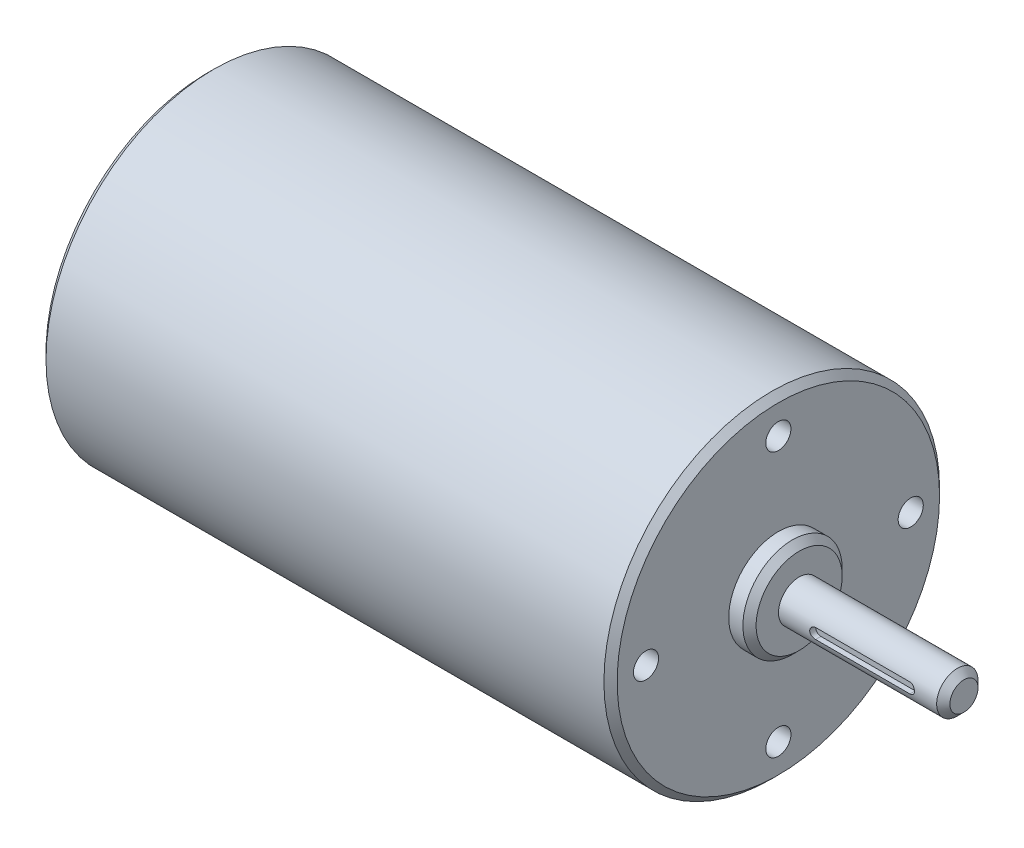
ISO-10303-21;
HEADER;
FILE_DESCRIPTION(('STEP AP214'),'2;1');
FILE_NAME('part.step','',(''),(''),'','','');
FILE_SCHEMA(('AUTOMOTIVE_DESIGN { 1 0 10303 214 1 1 1 1 }'));
ENDSEC;
DATA;
#1=APPLICATION_CONTEXT('core data for automotive mechanical design processes');
#2=APPLICATION_PROTOCOL_DEFINITION('international standard','automotive_design',2000,#1);
#3=PRODUCT_CONTEXT('',#1,'mechanical');
#4=PRODUCT('Part','Part','',(#3));
#5=PRODUCT_RELATED_PRODUCT_CATEGORY('part','',(#4));
#6=PRODUCT_DEFINITION_FORMATION('','',#4);
#7=PRODUCT_DEFINITION_CONTEXT('part definition',#1,'design');
#8=PRODUCT_DEFINITION('design','',#6,#7);
#9=PRODUCT_DEFINITION_SHAPE('','',#8);
#10=(LENGTH_UNIT() NAMED_UNIT(*) SI_UNIT(.MILLI.,.METRE.));
#11=(NAMED_UNIT(*) PLANE_ANGLE_UNIT() SI_UNIT($,.RADIAN.));
#12=(NAMED_UNIT(*) SI_UNIT($,.STERADIAN.) SOLID_ANGLE_UNIT());
#13=UNCERTAINTY_MEASURE_WITH_UNIT(LENGTH_MEASURE(1.E-05),#10,'distance_accuracy_value','');
#14=(GEOMETRIC_REPRESENTATION_CONTEXT(3) GLOBAL_UNCERTAINTY_ASSIGNED_CONTEXT((#13)) GLOBAL_UNIT_ASSIGNED_CONTEXT((#10,
#11,#12)) REPRESENTATION_CONTEXT('',''));
#15=CARTESIAN_POINT('',(0.,0.,0.));
#16=DIRECTION('',(0.,0.,1.));
#17=DIRECTION('',(1.,0.,0.));
#18=AXIS2_PLACEMENT_3D('',#15,#16,#17);
#19=CARTESIAN_POINT('',(0.,0.,0.));
#20=DIRECTION('',(1.,0.,0.));
#21=DIRECTION('',(0.,0.,-1.));
#22=AXIS2_PLACEMENT_3D('',#19,#20,#21);
#23=PLANE('',#22);
#24=CARTESIAN_POINT('',(0.,0.,0.));
#25=DIRECTION('',(1.,0.,0.));
#26=DIRECTION('',(0.,0.,-1.));
#27=AXIS2_PLACEMENT_3D('',#24,#25,#26);
#28=CIRCLE('',#27,30.9372);
#29=CARTESIAN_POINT('',(0.,0.,-30.9372));
#30=VERTEX_POINT('',#29);
#31=EDGE_CURVE('E117',#30,#30,#28,.F.);
#32=ORIENTED_EDGE('',*,*,#31,.T.);
#33=EDGE_LOOP('',(#32));
#34=FACE_BOUND('',#33,.T.);
#35=CARTESIAN_POINT('',(0.,0.,0.));
#36=DIRECTION('',(1.,0.,0.));
#37=DIRECTION('',(0.,0.,-1.));
#38=AXIS2_PLACEMENT_3D('',#35,#36,#37);
#39=CIRCLE('',#38,15.24);
#40=CARTESIAN_POINT('',(0.,0.,-15.24));
#41=VERTEX_POINT('',#40);
#42=EDGE_CURVE('E138',#41,#41,#39,.F.);
#43=ORIENTED_EDGE('',*,*,#42,.F.);
#44=EDGE_LOOP('',(#43));
#45=FACE_BOUND('',#44,.T.);
#46=ADVANCED_FACE('F34',(#34,#45),#23,.F.);
#47=CARTESIAN_POINT('',(113.5888,0.,0.));
#48=DIRECTION('',(1.,0.,0.));
#49=DIRECTION('',(0.,0.,-1.));
#50=AXIS2_PLACEMENT_3D('',#47,#48,#49);
#51=PLANE('',#50);
#52=CARTESIAN_POINT('',(113.5888,0.,0.));
#53=DIRECTION('',(1.,0.,0.));
#54=DIRECTION('',(0.,0.,-1.));
#55=AXIS2_PLACEMENT_3D('',#52,#53,#54);
#56=CIRCLE('',#55,8.25499999999998);
#57=CARTESIAN_POINT('',(113.5888,0.,-8.25499999999998));
#58=VERTEX_POINT('',#57);
#59=EDGE_CURVE('E126',#58,#58,#56,.T.);
#60=ORIENTED_EDGE('',*,*,#59,.T.);
#61=EDGE_LOOP('',(#60));
#62=FACE_BOUND('',#61,.T.);
#63=CARTESIAN_POINT('',(113.5888,0.,0.));
#64=DIRECTION('',(1.,0.,0.));
#65=DIRECTION('',(0.,0.,-1.));
#66=AXIS2_PLACEMENT_3D('',#63,#64,#65);
#67=CIRCLE('',#66,3.96875);
#68=CARTESIAN_POINT('',(113.5888,0.,-3.96875));
#69=VERTEX_POINT('',#68);
#70=EDGE_CURVE('E105',#69,#69,#67,.T.);
#71=ORIENTED_EDGE('',*,*,#70,.F.);
#72=EDGE_LOOP('',(#71));
#73=FACE_BOUND('',#72,.T.);
#74=ADVANCED_FACE('F196',(#62,#73),#51,.T.);
#75=CARTESIAN_POINT('',(109.601,0.,0.));
#76=DIRECTION('',(1.,0.,0.));
#77=DIRECTION('',(0.,0.,-1.));
#78=AXIS2_PLACEMENT_3D('',#75,#76,#77);
#79=PLANE('',#78);
#80=CARTESIAN_POINT('',(109.601,-3.54734504026462E-13,25.3999999999996));
#81=DIRECTION('',(1.,0.,0.));
#82=DIRECTION('',(0.,0.,-1.));
#83=AXIS2_PLACEMENT_3D('',#80,#81,#82);
#84=CIRCLE('',#83,2.4130000000007);
#85=CARTESIAN_POINT('',(109.601,-3.54734504026462E-13,22.9869999999989));
#86=VERTEX_POINT('',#85);
#87=EDGE_CURVE('E442',#86,#86,#84,.T.);
#88=ORIENTED_EDGE('',*,*,#87,.F.);
#89=EDGE_LOOP('',(#88));
#90=FACE_BOUND('',#89,.T.);
#91=CARTESIAN_POINT('',(109.601,-25.4,-7.15690213792593E-13));
#92=DIRECTION('',(1.,0.,0.));
#93=DIRECTION('',(0.,0.,-1.));
#94=AXIS2_PLACEMENT_3D('',#91,#92,#93);
#95=CIRCLE('',#94,2.41300000000085);
#96=CARTESIAN_POINT('',(109.601,-25.4,-2.41300000000157));
#97=VERTEX_POINT('',#96);
#98=EDGE_CURVE('E446',#97,#97,#95,.T.);
#99=ORIENTED_EDGE('',*,*,#98,.F.);
#100=EDGE_LOOP('',(#99));
#101=FACE_BOUND('',#100,.T.);
#102=CARTESIAN_POINT('',(109.601,0.,-25.4));
#103=DIRECTION('',(1.,0.,0.));
#104=DIRECTION('',(0.,0.,-1.));
#105=AXIS2_PLACEMENT_3D('',#102,#103,#104);
#106=CIRCLE('',#105,2.413);
#107=CARTESIAN_POINT('',(109.601,0.,-27.813));
#108=VERTEX_POINT('',#107);
#109=EDGE_CURVE('E450',#108,#108,#106,.T.);
#110=ORIENTED_EDGE('',*,*,#109,.F.);
#111=EDGE_LOOP('',(#110));
#112=FACE_BOUND('',#111,.T.);
#113=CARTESIAN_POINT('',(109.601,25.4,0.));
#114=DIRECTION('',(1.,0.,0.));
#115=DIRECTION('',(0.,0.,-1.));
#116=AXIS2_PLACEMENT_3D('',#113,#114,#115);
#117=CIRCLE('',#116,2.413);
#118=CARTESIAN_POINT('',(109.601,25.4,-2.413));
#119=VERTEX_POINT('',#118);
#120=EDGE_CURVE('E97',#119,#119,#117,.T.);
#121=ORIENTED_EDGE('',*,*,#120,.F.);
#122=EDGE_LOOP('',(#121));
#123=FACE_BOUND('',#122,.T.);
#124=CARTESIAN_POINT('',(109.601,0.,0.));
#125=DIRECTION('',(1.,0.,0.));
#126=DIRECTION('',(0.,0.,-1.));
#127=AXIS2_PLACEMENT_3D('',#124,#125,#126);
#128=CIRCLE('',#127,30.9372);
#129=CARTESIAN_POINT('',(109.601,0.,-30.9372));
#130=VERTEX_POINT('',#129);
#131=EDGE_CURVE('E120',#130,#130,#128,.T.);
#132=ORIENTED_EDGE('',*,*,#131,.T.);
#133=EDGE_LOOP('',(#132));
#134=FACE_BOUND('',#133,.T.);
#135=CARTESIAN_POINT('',(109.601,0.,0.));
#136=DIRECTION('',(1.,0.,0.));
#137=DIRECTION('',(0.,0.,-1.));
#138=AXIS2_PLACEMENT_3D('',#135,#136,#137);
#139=CIRCLE('',#138,9.525);
#140=CARTESIAN_POINT('',(109.601,0.,-9.525));
#141=VERTEX_POINT('',#140);
#142=EDGE_CURVE('E111',#141,#141,#139,.T.);
#143=ORIENTED_EDGE('',*,*,#142,.F.);
#144=EDGE_LOOP('',(#143));
#145=FACE_BOUND('',#144,.T.);
#146=ADVANCED_FACE('F202',(#90,#101,#112,#123,#134,#145),#79,.T.);
#147=CARTESIAN_POINT('',(109.601,0.,0.));
#148=DIRECTION('',(-1.,0.,0.));
#149=DIRECTION('',(0.,0.,1.));
#150=AXIS2_PLACEMENT_3D('',#147,#148,#149);
#151=CYLINDRICAL_SURFACE('',#150,32.2072);
#152=CARTESIAN_POINT('',(108.331,0.,0.));
#153=DIRECTION('',(1.,0.,0.));
#154=DIRECTION('',(0.,0.,-1.));
#155=AXIS2_PLACEMENT_3D('',#152,#153,#154);
#156=CIRCLE('',#155,32.2072);
#157=CARTESIAN_POINT('',(108.331,0.,-32.2072));
#158=VERTEX_POINT('',#157);
#159=EDGE_CURVE('E123',#158,#158,#156,.F.);
#160=ORIENTED_EDGE('',*,*,#159,.T.);
#161=EDGE_LOOP('',(#160));
#162=FACE_BOUND('',#161,.T.);
#163=CARTESIAN_POINT('',(1.26999999999999,0.,0.));
#164=DIRECTION('',(1.,0.,0.));
#165=DIRECTION('',(0.,0.,-1.));
#166=AXIS2_PLACEMENT_3D('',#163,#164,#165);
#167=CIRCLE('',#166,32.2072);
#168=CARTESIAN_POINT('',(1.26999999999999,0.,-32.2072));
#169=VERTEX_POINT('',#168);
#170=EDGE_CURVE('E114',#169,#169,#167,.T.);
#171=ORIENTED_EDGE('',*,*,#170,.T.);
#172=EDGE_LOOP('',(#171));
#173=FACE_BOUND('',#172,.T.);
#174=ADVANCED_FACE('F208',(#162,#173),#151,.T.);
#175=CARTESIAN_POINT('',(1.26999999999999,0.,0.));
#176=DIRECTION('',(1.,0.,0.));
#177=DIRECTION('',(0.,0.,-1.));
#178=AXIS2_PLACEMENT_3D('',#175,#176,#177);
#179=CONICAL_SURFACE('',#178,32.2072,0.785398163397456);
#180=ORIENTED_EDGE('',*,*,#31,.F.);
#181=EDGE_LOOP('',(#180));
#182=FACE_BOUND('',#181,.T.);
#183=ORIENTED_EDGE('',*,*,#170,.F.);
#184=EDGE_LOOP('',(#183));
#185=FACE_BOUND('',#184,.T.);
#186=ADVANCED_FACE('F211',(#182,#185),#179,.T.);
#187=CARTESIAN_POINT('',(109.601,0.,0.));
#188=DIRECTION('',(-1.,0.,0.));
#189=DIRECTION('',(0.,0.,1.));
#190=AXIS2_PLACEMENT_3D('',#187,#188,#189);
#191=CONICAL_SURFACE('',#190,30.9372,0.78539816339744);
#192=ORIENTED_EDGE('',*,*,#159,.F.);
#193=EDGE_LOOP('',(#192));
#194=FACE_BOUND('',#193,.T.);
#195=ORIENTED_EDGE('',*,*,#131,.F.);
#196=EDGE_LOOP('',(#195));
#197=FACE_BOUND('',#196,.T.);
#198=ADVANCED_FACE('F215',(#194,#197),#191,.T.);
#199=CARTESIAN_POINT('',(113.5888,0.,0.));
#200=DIRECTION('',(-1.,0.,0.));
#201=DIRECTION('',(0.,0.,1.));
#202=AXIS2_PLACEMENT_3D('',#199,#200,#201);
#203=CYLINDRICAL_SURFACE('',#202,9.525);
#204=CARTESIAN_POINT('',(112.3188,0.,0.));
#205=DIRECTION('',(1.,0.,0.));
#206=DIRECTION('',(0.,0.,-1.));
#207=AXIS2_PLACEMENT_3D('',#204,#205,#206);
#208=CIRCLE('',#207,9.525);
#209=CARTESIAN_POINT('',(112.3188,0.,-9.525));
#210=VERTEX_POINT('',#209);
#211=EDGE_CURVE('E129',#210,#210,#208,.F.);
#212=ORIENTED_EDGE('',*,*,#211,.T.);
#213=EDGE_LOOP('',(#212));
#214=FACE_BOUND('',#213,.T.);
#215=ORIENTED_EDGE('',*,*,#142,.T.);
#216=EDGE_LOOP('',(#215));
#217=FACE_BOUND('',#216,.T.);
#218=ADVANCED_FACE('F193',(#214,#217),#203,.T.);
#219=CARTESIAN_POINT('',(145.2118,0.,0.));
#220=DIRECTION('',(-1.,0.,0.));
#221=DIRECTION('',(0.,0.,1.));
#222=AXIS2_PLACEMENT_3D('',#219,#220,#221);
#223=CYLINDRICAL_SURFACE('',#222,3.96875);
#224=DIRECTION('',(-1.,0.,0.));
#225=VECTOR('',#224,1.);
#226=CARTESIAN_POINT('',(145.2118,0.99949,3.84083276157658));
#227=LINE('',#226,#225);
#228=CARTESIAN_POINT('',(120.58269,0.99949,3.84083276157658));
#229=VERTEX_POINT('',#228);
#230=CARTESIAN_POINT('',(138.68273,0.99949,3.84083276157658));
#231=VERTEX_POINT('',#230);
#232=EDGE_CURVE('E11',#229,#231,#227,.F.);
#233=ORIENTED_EDGE('',*,*,#232,.T.);
#234=CARTESIAN_POINT('',(138.68273,0.99949,3.84083276157658));
#235=CARTESIAN_POINT('',(138.710371855366,0.99949034508258,3.84083088535486));
#236=CARTESIAN_POINT('',(138.738000006681,0.998342576022411,3.84113154192625));
#237=CARTESIAN_POINT('',(138.793049543949,0.993767145090672,3.84231853671911));
#238=CARTESIAN_POINT('',(138.820470964276,0.990339871100076,3.84320477529766));
#239=CARTESIAN_POINT('',(138.902013552574,0.976688942242754,3.84670622445485));
#240=CARTESIAN_POINT('',(138.95557415162,0.96309595921762,3.8501643895329));
#241=CARTESIAN_POINT('',(139.059558693131,0.927365951048453,3.8589250519512));
#242=CARTESIAN_POINT('',(139.109982956344,0.905229801274279,3.86422736032704));
#243=CARTESIAN_POINT('',(139.206427816238,0.853068713817862,3.87607577201493));
#244=CARTESIAN_POINT('',(139.252447197867,0.823041607982738,3.88262221703424));
#245=CARTESIAN_POINT('',(139.339772900892,0.755242877856895,3.89638316090741));
#246=CARTESIAN_POINT('',(139.380966638586,0.717328459170463,3.9036083969745));
#247=CARTESIAN_POINT('',(139.456486118574,0.635135353050957,3.91782036547613));
#248=CARTESIAN_POINT('',(139.490810761316,0.590855648657175,3.92480705957846));
#249=CARTESIAN_POINT('',(139.552077986148,0.49641361018235,3.93787391802068));
#250=CARTESIAN_POINT('',(139.57890911343,0.446176832822011,3.94393983940319));
#251=CARTESIAN_POINT('',(139.623701811812,0.341730216786056,3.95435799835552));
#252=CARTESIAN_POINT('',(139.641665146491,0.287521170558453,3.95871057663079));
#253=CARTESIAN_POINT('',(139.66785096089,0.177847779961227,3.96513566928748));
#254=CARTESIAN_POINT('',(139.676265855839,0.122432057522644,3.96725316041096));
#255=CARTESIAN_POINT('',(139.683720120741,0.0109364897009776,3.96912630891355));
#256=CARTESIAN_POINT('',(139.682760689181,-0.045143269870698,3.96888226820973));
#257=CARTESIAN_POINT('',(139.671631248994,-0.155037457909628,3.96609318102902));
#258=CARTESIAN_POINT('',(139.661669160231,-0.208874460448489,3.96360007973907));
#259=CARTESIAN_POINT('',(139.633151687584,-0.314086111079225,3.95665360881696));
#260=CARTESIAN_POINT('',(139.614595920318,-0.36546064920236,3.95220015172949));
#261=CARTESIAN_POINT('',(139.569250319442,-0.464836153211505,3.94175409964869));
#262=CARTESIAN_POINT('',(139.542386681345,-0.512801940790663,3.93574779138535));
#263=CARTESIAN_POINT('',(139.481244450101,-0.603616233347936,3.9228472937741));
#264=CARTESIAN_POINT('',(139.446964720246,-0.646463952283368,3.9159529683799));
#265=CARTESIAN_POINT('',(139.37085470223,-0.727062667015122,3.90180452536138));
#266=CARTESIAN_POINT('',(139.328843536622,-0.764642201053514,3.89454572456579));
#267=CARTESIAN_POINT('',(139.239027431868,-0.832270101802583,3.8806569962431));
#268=CARTESIAN_POINT('',(139.19122091086,-0.862316405394657,3.8740272413005));
#269=CARTESIAN_POINT('',(139.090823163687,-0.914139275858822,3.86212887883412));
#270=CARTESIAN_POINT('',(139.038207004781,-0.935869323009422,3.85686797939342));
#271=CARTESIAN_POINT('',(138.929934724949,-0.970093898104302,3.84840362082549));
#272=CARTESIAN_POINT('',(138.874283285139,-0.982602238420151,3.84519708559696));
#273=CARTESIAN_POINT('',(138.795578801122,-0.993358173202812,3.84242408867529));
#274=CARTESIAN_POINT('',(138.773055913649,-0.995657985499729,3.84182827516651));
#275=CARTESIAN_POINT('',(138.727935595249,-0.998722182802392,3.84103278115428));
#276=CARTESIAN_POINT('',(138.705338343949,-0.999489046647041,3.84083246112855));
#277=CARTESIAN_POINT('',(138.68273,-0.99949,3.84083276157658));
#278=B_SPLINE_CURVE_WITH_KNOTS('',3,(#234,#235,#236,#237,#238,#239,#240,#241,#242,#243,#244,
#245,#246,#247,#248,#249,#250,#251,#252,#253,#254,#255,#256,#257,#258,#259,#260,#261,#262,#263,
#264,#265,#266,#267,#268,#269,#270,#271,#272,#273,#274,#275,#276,#277),.UNSPECIFIED.,.F.,.F.,(4,
2,2,2,2,2,2,2,2,2,2,2,2,2,2,2,2,2,2,2,2,4),(0.,0.0828731579444143,0.165732217783698,
0.330973339294841,0.496197533978411,0.66146717392123,0.830040056608364,0.998639901623819,
1.1696279790933,1.34058203766956,1.5080262825965,1.67544912039758,1.83910139518618,
2.00276097156208,2.16791837132419,2.33310110374766,2.50280192406036,2.67254916953174,
2.84323253669063,3.0136597301703,3.08155871780525,3.14934782095868),.UNSPECIFIED.);
#279=CARTESIAN_POINT('',(138.68273,-0.99949,3.84083276157658));
#280=VERTEX_POINT('',#279);
#281=EDGE_CURVE('E147',#231,#280,#278,.T.);
#282=ORIENTED_EDGE('',*,*,#281,.T.);
#283=DIRECTION('',(-1.,0.,0.));
#284=VECTOR('',#283,1.);
#285=CARTESIAN_POINT('',(145.2118,-0.99949,3.84083276157658));
#286=LINE('',#285,#284);
#287=CARTESIAN_POINT('',(120.58269,-0.99949,3.84083276157658));
#288=VERTEX_POINT('',#287);
#289=EDGE_CURVE('E42',#280,#288,#286,.T.);
#290=ORIENTED_EDGE('',*,*,#289,.T.);
#291=CARTESIAN_POINT('',(120.58269,-0.99949,3.84083276157658));
#292=CARTESIAN_POINT('',(120.555048144634,-0.999490345082581,3.84083088535486));
#293=CARTESIAN_POINT('',(120.527419993319,-0.998342576022412,3.84113154192625));
#294=CARTESIAN_POINT('',(120.472370456051,-0.993767145090673,3.84231853671911));
#295=CARTESIAN_POINT('',(120.444949035724,-0.990339871100075,3.84320477529766));
#296=CARTESIAN_POINT('',(120.363406447426,-0.976688942242751,3.84670622445485));
#297=CARTESIAN_POINT('',(120.30984584838,-0.963095959217618,3.8501643895329));
#298=CARTESIAN_POINT('',(120.205861306869,-0.927365951048453,3.8589250519512));
#299=CARTESIAN_POINT('',(120.155437043656,-0.905229801274277,3.86422736032704));
#300=CARTESIAN_POINT('',(120.058992183762,-0.853068713817854,3.87607577201493));
#301=CARTESIAN_POINT('',(120.012972802133,-0.823041607982726,3.88262221703424));
#302=CARTESIAN_POINT('',(119.925647099108,-0.755242877856881,3.89638316090742));
#303=CARTESIAN_POINT('',(119.884453361414,-0.717328459170449,3.9036083969745));
#304=CARTESIAN_POINT('',(119.808933881426,-0.63513535305094,3.91782036547613));
#305=CARTESIAN_POINT('',(119.774609238684,-0.590855648657156,3.92480705957846));
#306=CARTESIAN_POINT('',(119.713342013852,-0.496413610182332,3.93787391802068));
#307=CARTESIAN_POINT('',(119.68651088657,-0.446176832821996,3.94393983940319));
#308=CARTESIAN_POINT('',(119.641718188188,-0.341730216786044,3.95435799835552));
#309=CARTESIAN_POINT('',(119.623754853509,-0.287521170558441,3.95871057663079));
#310=CARTESIAN_POINT('',(119.59756903911,-0.177847779961219,3.96513566928748));
#311=CARTESIAN_POINT('',(119.589154144161,-0.122432057522639,3.96725316041096));
#312=CARTESIAN_POINT('',(119.581699879259,-0.0109364897009769,3.96912630891355));
#313=CARTESIAN_POINT('',(119.582659310819,0.0451432698706966,3.96888226820973));
#314=CARTESIAN_POINT('',(119.593788751006,0.155037457909627,3.96609318102902));
#315=CARTESIAN_POINT('',(119.603750839769,0.208874460448488,3.96360007973907));
#316=CARTESIAN_POINT('',(119.632268312416,0.314086111079224,3.95665360881696));
#317=CARTESIAN_POINT('',(119.650824079682,0.365460649202358,3.95220015172949));
#318=CARTESIAN_POINT('',(119.696169680558,0.4648361532115,3.94175409964869));
#319=CARTESIAN_POINT('',(119.723033318655,0.512801940790658,3.93574779138535));
#320=CARTESIAN_POINT('',(119.784175549898,0.603616233347931,3.9228472937741));
#321=CARTESIAN_POINT('',(119.818455279754,0.646463952283364,3.9159529683799));
#322=CARTESIAN_POINT('',(119.89456529777,0.727062667015116,3.90180452536138));
#323=CARTESIAN_POINT('',(119.936576463378,0.764642201053506,3.89454572456579));
#324=CARTESIAN_POINT('',(120.026392568132,0.832270101802575,3.8806569962431));
#325=CARTESIAN_POINT('',(120.07419908914,0.862316405394651,3.8740272413005));
#326=CARTESIAN_POINT('',(120.174596836313,0.914139275858827,3.86212887883412));
#327=CARTESIAN_POINT('',(120.227212995219,0.935869323009432,3.85686797939342));
#328=CARTESIAN_POINT('',(120.335485275051,0.970093898104309,3.84840362082548));
#329=CARTESIAN_POINT('',(120.391136714861,0.982602238420156,3.84519708559696));
#330=CARTESIAN_POINT('',(120.469841198878,0.993358173202814,3.84242408867529));
#331=CARTESIAN_POINT('',(120.492364086351,0.995657985499731,3.84182827516651));
#332=CARTESIAN_POINT('',(120.537484404751,0.998722182802391,3.84103278115428));
#333=CARTESIAN_POINT('',(120.560081656051,0.99948904664704,3.84083246112855));
#334=CARTESIAN_POINT('',(120.58269,0.99949,3.84083276157658));
#335=B_SPLINE_CURVE_WITH_KNOTS('',3,(#291,#292,#293,#294,#295,#296,#297,#298,#299,#300,#301,
#302,#303,#304,#305,#306,#307,#308,#309,#310,#311,#312,#313,#314,#315,#316,#317,#318,#319,#320,
#321,#322,#323,#324,#325,#326,#327,#328,#329,#330,#331,#332,#333,#334),.UNSPECIFIED.,.F.,.F.,(4,
2,2,2,2,2,2,2,2,2,2,2,2,2,2,2,2,2,2,2,2,4),(0.,0.0828731579444004,0.165732217783698,
0.330973339294841,0.496197533978427,0.661467173921234,0.830040056608397,0.998639901623839,
1.16962797909332,1.34058203766957,1.50802628259651,1.67544912039758,1.83910139518618,
2.00276097156208,2.16791837132417,2.33310110374765,2.50280192406034,2.67254916953173,
2.84323253669067,3.01365973017031,3.08155871780528,3.14934782095868),.UNSPECIFIED.);
#336=EDGE_CURVE('E49',#288,#229,#335,.T.);
#337=ORIENTED_EDGE('',*,*,#336,.T.);
#338=EDGE_LOOP('',(#233,#282,#290,#337));
#339=FACE_BOUND('',#338,.T.);
#340=CARTESIAN_POINT('',(143.9418,0.,0.));
#341=DIRECTION('',(1.,0.,0.));
#342=DIRECTION('',(0.,0.,-1.));
#343=AXIS2_PLACEMENT_3D('',#340,#341,#342);
#344=CIRCLE('',#343,3.96875);
#345=CARTESIAN_POINT('',(143.9418,0.,-3.96875));
#346=VERTEX_POINT('',#345);
#347=EDGE_CURVE('E135',#346,#346,#344,.F.);
#348=ORIENTED_EDGE('',*,*,#347,.T.);
#349=EDGE_LOOP('',(#348));
#350=FACE_BOUND('',#349,.T.);
#351=ORIENTED_EDGE('',*,*,#70,.T.);
#352=EDGE_LOOP('',(#351));
#353=FACE_BOUND('',#352,.T.);
#354=ADVANCED_FACE('F159',(#339,#350,#353),#223,.T.);
#355=CARTESIAN_POINT('',(145.2118,0.,0.));
#356=DIRECTION('',(1.,0.,0.));
#357=DIRECTION('',(0.,0.,-1.));
#358=AXIS2_PLACEMENT_3D('',#355,#356,#357);
#359=PLANE('',#358);
#360=CARTESIAN_POINT('',(145.2118,0.,0.));
#361=DIRECTION('',(1.,0.,0.));
#362=DIRECTION('',(0.,0.,-1.));
#363=AXIS2_PLACEMENT_3D('',#360,#361,#362);
#364=CIRCLE('',#363,2.69875000000001);
#365=CARTESIAN_POINT('',(145.2118,0.,-2.69875000000001));
#366=VERTEX_POINT('',#365);
#367=EDGE_CURVE('E132',#366,#366,#364,.T.);
#368=ORIENTED_EDGE('',*,*,#367,.T.);
#369=EDGE_LOOP('',(#368));
#370=FACE_BOUND('',#369,.T.);
#371=ADVANCED_FACE('F183',(#370),#359,.T.);
#372=CARTESIAN_POINT('',(113.5888,0.,0.));
#373=DIRECTION('',(-1.,0.,0.));
#374=DIRECTION('',(0.,0.,1.));
#375=AXIS2_PLACEMENT_3D('',#372,#373,#374);
#376=CONICAL_SURFACE('',#375,8.25499999999998,0.785398163397446);
#377=ORIENTED_EDGE('',*,*,#211,.F.);
#378=EDGE_LOOP('',(#377));
#379=FACE_BOUND('',#378,.T.);
#380=ORIENTED_EDGE('',*,*,#59,.F.);
#381=EDGE_LOOP('',(#380));
#382=FACE_BOUND('',#381,.T.);
#383=ADVANCED_FACE('F185',(#379,#382),#376,.T.);
#384=CARTESIAN_POINT('',(145.2118,0.,0.));
#385=DIRECTION('',(-1.,0.,0.));
#386=DIRECTION('',(0.,0.,1.));
#387=AXIS2_PLACEMENT_3D('',#384,#385,#386);
#388=CONICAL_SURFACE('',#387,2.69875000000001,0.785398163397435);
#389=ORIENTED_EDGE('',*,*,#347,.F.);
#390=EDGE_LOOP('',(#389));
#391=FACE_BOUND('',#390,.T.);
#392=ORIENTED_EDGE('',*,*,#367,.F.);
#393=EDGE_LOOP('',(#392));
#394=FACE_BOUND('',#393,.T.);
#395=ADVANCED_FACE('F181',(#391,#394),#388,.T.);
#396=CARTESIAN_POINT('',(-3.9878,0.,0.));
#397=DIRECTION('',(1.,0.,0.));
#398=DIRECTION('',(0.,0.,-1.));
#399=AXIS2_PLACEMENT_3D('',#396,#397,#398);
#400=CYLINDRICAL_SURFACE('',#399,15.24);
#401=CARTESIAN_POINT('',(-2.71780000000005,0.,0.));
#402=DIRECTION('',(-1.,0.,0.));
#403=DIRECTION('',(0.,0.,1.));
#404=AXIS2_PLACEMENT_3D('',#401,#402,#403);
#405=CIRCLE('',#404,15.24);
#406=CARTESIAN_POINT('',(-2.71780000000005,0.,15.24));
#407=VERTEX_POINT('',#406);
#408=EDGE_CURVE('E144',#407,#407,#405,.F.);
#409=ORIENTED_EDGE('',*,*,#408,.T.);
#410=EDGE_LOOP('',(#409));
#411=FACE_BOUND('',#410,.T.);
#412=ORIENTED_EDGE('',*,*,#42,.T.);
#413=EDGE_LOOP('',(#412));
#414=FACE_BOUND('',#413,.T.);
#415=ADVANCED_FACE('F178',(#411,#414),#400,.T.);
#416=CARTESIAN_POINT('',(-3.9878,0.,0.));
#417=DIRECTION('',(-1.,0.,0.));
#418=DIRECTION('',(0.,0.,1.));
#419=AXIS2_PLACEMENT_3D('',#416,#417,#418);
#420=PLANE('',#419);
#421=CARTESIAN_POINT('',(-3.9878,0.,0.));
#422=DIRECTION('',(-1.,0.,0.));
#423=DIRECTION('',(0.,0.,1.));
#424=AXIS2_PLACEMENT_3D('',#421,#422,#423);
#425=CIRCLE('',#424,13.97);
#426=CARTESIAN_POINT('',(-3.9878,0.,13.97));
#427=VERTEX_POINT('',#426);
#428=EDGE_CURVE('E141',#427,#427,#425,.T.);
#429=ORIENTED_EDGE('',*,*,#428,.T.);
#430=EDGE_LOOP('',(#429));
#431=FACE_BOUND('',#430,.T.);
#432=ADVANCED_FACE('F175',(#431),#420,.T.);
#433=CARTESIAN_POINT('',(-3.9878,0.,0.));
#434=DIRECTION('',(1.,0.,0.));
#435=DIRECTION('',(0.,0.,-1.));
#436=AXIS2_PLACEMENT_3D('',#433,#434,#435);
#437=CONICAL_SURFACE('',#436,13.97,0.785398163397457);
#438=ORIENTED_EDGE('',*,*,#408,.F.);
#439=EDGE_LOOP('',(#438));
#440=FACE_BOUND('',#439,.T.);
#441=ORIENTED_EDGE('',*,*,#428,.F.);
#442=EDGE_LOOP('',(#441));
#443=FACE_BOUND('',#442,.T.);
#444=ADVANCED_FACE('F36',(#440,#443),#437,.T.);
#445=CARTESIAN_POINT('',(120.58269,0.,2.81813));
#446=DIRECTION('',(0.,0.,1.));
#447=DIRECTION('',(1.,0.,0.));
#448=AXIS2_PLACEMENT_3D('',#445,#446,#447);
#449=CYLINDRICAL_SURFACE('',#448,0.99949);
#450=DIRECTION('',(0.,0.,1.));
#451=VECTOR('',#450,1.);
#452=CARTESIAN_POINT('',(120.58269,-0.99949,2.81813));
#453=LINE('',#452,#451);
#454=CARTESIAN_POINT('',(120.58269,-0.99949,2.81813));
#455=VERTEX_POINT('',#454);
#456=EDGE_CURVE('E72',#455,#288,#453,.T.);
#457=ORIENTED_EDGE('',*,*,#456,.F.);
#458=CARTESIAN_POINT('',(120.58269,0.,2.81813));
#459=DIRECTION('',(0.,0.,1.));
#460=DIRECTION('',(1.,0.,0.));
#461=AXIS2_PLACEMENT_3D('',#458,#459,#460);
#462=CIRCLE('',#461,0.99949);
#463=CARTESIAN_POINT('',(120.58269,0.99949,2.81813));
#464=VERTEX_POINT('',#463);
#465=EDGE_CURVE('E76',#464,#455,#462,.T.);
#466=ORIENTED_EDGE('',*,*,#465,.F.);
#467=DIRECTION('',(0.,0.,1.));
#468=VECTOR('',#467,1.);
#469=CARTESIAN_POINT('',(120.58269,0.99949,2.81813));
#470=LINE('',#469,#468);
#471=EDGE_CURVE('E103',#464,#229,#470,.T.);
#472=ORIENTED_EDGE('',*,*,#471,.T.);
#473=ORIENTED_EDGE('',*,*,#336,.F.);
#474=EDGE_LOOP('',(#457,#466,#472,#473));
#475=FACE_BOUND('',#474,.T.);
#476=ADVANCED_FACE('F74',(#475),#449,.F.);
#477=CARTESIAN_POINT('',(120.58269,0.99949,2.81813));
#478=DIRECTION('',(0.,1.,0.));
#479=DIRECTION('',(0.,0.,1.));
#480=AXIS2_PLACEMENT_3D('',#477,#478,#479);
#481=PLANE('',#480);
#482=ORIENTED_EDGE('',*,*,#471,.F.);
#483=DIRECTION('',(-1.,0.,0.));
#484=VECTOR('',#483,1.);
#485=CARTESIAN_POINT('',(120.58269,0.99949,2.81813));
#486=LINE('',#485,#484);
#487=CARTESIAN_POINT('',(138.68273,0.99949,2.81813));
#488=VERTEX_POINT('',#487);
#489=EDGE_CURVE('E81',#488,#464,#486,.T.);
#490=ORIENTED_EDGE('',*,*,#489,.F.);
#491=DIRECTION('',(0.,0.,1.));
#492=VECTOR('',#491,1.);
#493=CARTESIAN_POINT('',(138.68273,0.99949,2.81813));
#494=LINE('',#493,#492);
#495=EDGE_CURVE('E106',#488,#231,#494,.T.);
#496=ORIENTED_EDGE('',*,*,#495,.T.);
#497=ORIENTED_EDGE('',*,*,#232,.F.);
#498=EDGE_LOOP('',(#482,#490,#496,#497));
#499=FACE_BOUND('',#498,.T.);
#500=ADVANCED_FACE('F168',(#499),#481,.F.);
#501=CARTESIAN_POINT('',(138.68273,0.,2.81813));
#502=DIRECTION('',(0.,0.,1.));
#503=DIRECTION('',(1.,0.,0.));
#504=AXIS2_PLACEMENT_3D('',#501,#502,#503);
#505=CYLINDRICAL_SURFACE('',#504,0.99949);
#506=ORIENTED_EDGE('',*,*,#495,.F.);
#507=CARTESIAN_POINT('',(138.68273,0.,2.81813));
#508=DIRECTION('',(0.,0.,1.));
#509=DIRECTION('',(1.,0.,0.));
#510=AXIS2_PLACEMENT_3D('',#507,#508,#509);
#511=CIRCLE('',#510,0.99949);
#512=CARTESIAN_POINT('',(138.68273,-0.99949,2.81813));
#513=VERTEX_POINT('',#512);
#514=EDGE_CURVE('E90',#513,#488,#511,.T.);
#515=ORIENTED_EDGE('',*,*,#514,.F.);
#516=DIRECTION('',(0.,0.,1.));
#517=VECTOR('',#516,1.);
#518=CARTESIAN_POINT('',(138.68273,-0.99949,2.81813));
#519=LINE('',#518,#517);
#520=EDGE_CURVE('E80',#513,#280,#519,.T.);
#521=ORIENTED_EDGE('',*,*,#520,.T.);
#522=ORIENTED_EDGE('',*,*,#281,.F.);
#523=EDGE_LOOP('',(#506,#515,#521,#522));
#524=FACE_BOUND('',#523,.T.);
#525=ADVANCED_FACE('F163',(#524),#505,.F.);
#526=CARTESIAN_POINT('',(120.58269,-0.99949,2.81813));
#527=DIRECTION('',(0.,-1.,0.));
#528=DIRECTION('',(0.,0.,-1.));
#529=AXIS2_PLACEMENT_3D('',#526,#527,#528);
#530=PLANE('',#529);
#531=ORIENTED_EDGE('',*,*,#520,.F.);
#532=DIRECTION('',(1.,0.,0.));
#533=VECTOR('',#532,1.);
#534=CARTESIAN_POINT('',(120.58269,-0.99949,2.81813));
#535=LINE('',#534,#533);
#536=EDGE_CURVE('E84',#455,#513,#535,.T.);
#537=ORIENTED_EDGE('',*,*,#536,.F.);
#538=ORIENTED_EDGE('',*,*,#456,.T.);
#539=ORIENTED_EDGE('',*,*,#289,.F.);
#540=EDGE_LOOP('',(#531,#537,#538,#539));
#541=FACE_BOUND('',#540,.T.);
#542=ADVANCED_FACE('F85',(#541),#530,.F.);
#543=CARTESIAN_POINT('',(120.58269,0.,2.81813));
#544=DIRECTION('',(0.,0.,1.));
#545=DIRECTION('',(1.,0.,0.));
#546=AXIS2_PLACEMENT_3D('',#543,#544,#545);
#547=PLANE('',#546);
#548=ORIENTED_EDGE('',*,*,#465,.T.);
#549=ORIENTED_EDGE('',*,*,#536,.T.);
#550=ORIENTED_EDGE('',*,*,#514,.T.);
#551=ORIENTED_EDGE('',*,*,#489,.T.);
#552=EDGE_LOOP('',(#548,#549,#550,#551));
#553=FACE_BOUND('',#552,.T.);
#554=ADVANCED_FACE('F92',(#553),#547,.T.);
#555=CARTESIAN_POINT('',(103.251,25.4,0.));
#556=DIRECTION('',(1.,0.,0.));
#557=DIRECTION('',(0.,0.,-1.));
#558=AXIS2_PLACEMENT_3D('',#555,#556,#557);
#559=CYLINDRICAL_SURFACE('',#558,2.413);
#560=CARTESIAN_POINT('',(103.251,25.4,0.));
#561=DIRECTION('',(1.,0.,0.));
#562=DIRECTION('',(0.,0.,-1.));
#563=AXIS2_PLACEMENT_3D('',#560,#561,#562);
#564=CIRCLE('',#563,2.413);
#565=CARTESIAN_POINT('',(103.251,25.4,-2.413));
#566=VERTEX_POINT('',#565);
#567=EDGE_CURVE('E94',#566,#566,#564,.T.);
#568=ORIENTED_EDGE('',*,*,#567,.F.);
#569=EDGE_LOOP('',(#568));
#570=FACE_BOUND('',#569,.T.);
#571=ORIENTED_EDGE('',*,*,#120,.T.);
#572=EDGE_LOOP('',(#571));
#573=FACE_BOUND('',#572,.T.);
#574=ADVANCED_FACE('F270',(#570,#573),#559,.F.);
#575=CARTESIAN_POINT('',(103.251,25.4,0.));
#576=DIRECTION('',(1.,0.,0.));
#577=DIRECTION('',(0.,0.,-1.));
#578=AXIS2_PLACEMENT_3D('',#575,#576,#577);
#579=PLANE('',#578);
#580=ORIENTED_EDGE('',*,*,#567,.T.);
#581=EDGE_LOOP('',(#580));
#582=FACE_BOUND('',#581,.T.);
#583=ADVANCED_FACE('F277',(#582),#579,.T.);
#584=CARTESIAN_POINT('',(103.251,0.,-25.4));
#585=DIRECTION('',(1.,0.,0.));
#586=DIRECTION('',(0.,0.,-1.));
#587=AXIS2_PLACEMENT_3D('',#584,#585,#586);
#588=CYLINDRICAL_SURFACE('',#587,2.413);
#589=CARTESIAN_POINT('',(103.251,0.,-25.4));
#590=DIRECTION('',(1.,0.,0.));
#591=DIRECTION('',(0.,0.,-1.));
#592=AXIS2_PLACEMENT_3D('',#589,#590,#591);
#593=CIRCLE('',#592,2.413);
#594=CARTESIAN_POINT('',(103.251,0.,-27.813));
#595=VERTEX_POINT('',#594);
#596=EDGE_CURVE('E460',#595,#595,#593,.T.);
#597=ORIENTED_EDGE('',*,*,#596,.F.);
#598=EDGE_LOOP('',(#597));
#599=FACE_BOUND('',#598,.T.);
#600=ORIENTED_EDGE('',*,*,#109,.T.);
#601=EDGE_LOOP('',(#600));
#602=FACE_BOUND('',#601,.T.);
#603=ADVANCED_FACE('F285',(#599,#602),#588,.F.);
#604=CARTESIAN_POINT('',(103.251,0.,-25.4));
#605=DIRECTION('',(1.,0.,0.));
#606=DIRECTION('',(0.,0.,-1.));
#607=AXIS2_PLACEMENT_3D('',#604,#605,#606);
#608=PLANE('',#607);
#609=ORIENTED_EDGE('',*,*,#596,.T.);
#610=EDGE_LOOP('',(#609));
#611=FACE_BOUND('',#610,.T.);
#612=ADVANCED_FACE('F293',(#611),#608,.T.);
#613=CARTESIAN_POINT('',(103.251,-25.4,-7.15690213792593E-13));
#614=DIRECTION('',(1.,0.,0.));
#615=DIRECTION('',(0.,0.,-1.));
#616=AXIS2_PLACEMENT_3D('',#613,#614,#615);
#617=CYLINDRICAL_SURFACE('',#616,2.41300000000085);
#618=CARTESIAN_POINT('',(103.251,-25.4,-7.15690213792593E-13));
#619=DIRECTION('',(1.,0.,0.));
#620=DIRECTION('',(0.,0.,-1.));
#621=AXIS2_PLACEMENT_3D('',#618,#619,#620);
#622=CIRCLE('',#621,2.41300000000085);
#623=CARTESIAN_POINT('',(103.251,-25.4,-2.41300000000157));
#624=VERTEX_POINT('',#623);
#625=EDGE_CURVE('E464',#624,#624,#622,.T.);
#626=ORIENTED_EDGE('',*,*,#625,.F.);
#627=EDGE_LOOP('',(#626));
#628=FACE_BOUND('',#627,.T.);
#629=ORIENTED_EDGE('',*,*,#98,.T.);
#630=EDGE_LOOP('',(#629));
#631=FACE_BOUND('',#630,.T.);
#632=ADVANCED_FACE('F301',(#628,#631),#617,.F.);
#633=CARTESIAN_POINT('',(103.251,-25.4,-7.15690213792593E-13));
#634=DIRECTION('',(1.,0.,0.));
#635=DIRECTION('',(0.,0.,-1.));
#636=AXIS2_PLACEMENT_3D('',#633,#634,#635);
#637=PLANE('',#636);
#638=ORIENTED_EDGE('',*,*,#625,.T.);
#639=EDGE_LOOP('',(#638));
#640=FACE_BOUND('',#639,.T.);
#641=ADVANCED_FACE('F309',(#640),#637,.T.);
#642=CARTESIAN_POINT('',(103.251,-3.54734504026462E-13,25.3999999999996));
#643=DIRECTION('',(1.,0.,0.));
#644=DIRECTION('',(0.,0.,-1.));
#645=AXIS2_PLACEMENT_3D('',#642,#643,#644);
#646=CYLINDRICAL_SURFACE('',#645,2.4130000000007);
#647=CARTESIAN_POINT('',(103.251,-3.54734504026462E-13,25.3999999999996));
#648=DIRECTION('',(1.,0.,0.));
#649=DIRECTION('',(0.,0.,-1.));
#650=AXIS2_PLACEMENT_3D('',#647,#648,#649);
#651=CIRCLE('',#650,2.4130000000007);
#652=CARTESIAN_POINT('',(103.251,-3.54734504026462E-13,22.9869999999989));
#653=VERTEX_POINT('',#652);
#654=EDGE_CURVE('E468',#653,#653,#651,.T.);
#655=ORIENTED_EDGE('',*,*,#654,.F.);
#656=EDGE_LOOP('',(#655));
#657=FACE_BOUND('',#656,.T.);
#658=ORIENTED_EDGE('',*,*,#87,.T.);
#659=EDGE_LOOP('',(#658));
#660=FACE_BOUND('',#659,.T.);
#661=ADVANCED_FACE('F317',(#657,#660),#646,.F.);
#662=CARTESIAN_POINT('',(103.251,-3.54734504026462E-13,25.3999999999996));
#663=DIRECTION('',(1.,0.,0.));
#664=DIRECTION('',(0.,0.,-1.));
#665=AXIS2_PLACEMENT_3D('',#662,#663,#664);
#666=PLANE('',#665);
#667=ORIENTED_EDGE('',*,*,#654,.T.);
#668=EDGE_LOOP('',(#667));
#669=FACE_BOUND('',#668,.T.);
#670=ADVANCED_FACE('F325',(#669),#666,.T.);
#671=CLOSED_SHELL('',(#46,#74,#146,#174,#186,#198,#218,#354,#371,#383,#395,#415,#432,#444,#476,
#500,#525,#542,#554,#574,#583,#603,#612,#632,#641,#661,#670));
#672=MANIFOLD_SOLID_BREP('B2',#671);
#673=ADVANCED_BREP_SHAPE_REPRESENTATION('',(#18,#672),#14);
#674=SHAPE_DEFINITION_REPRESENTATION(#9,#673);
ENDSEC;
END-ISO-10303-21;
